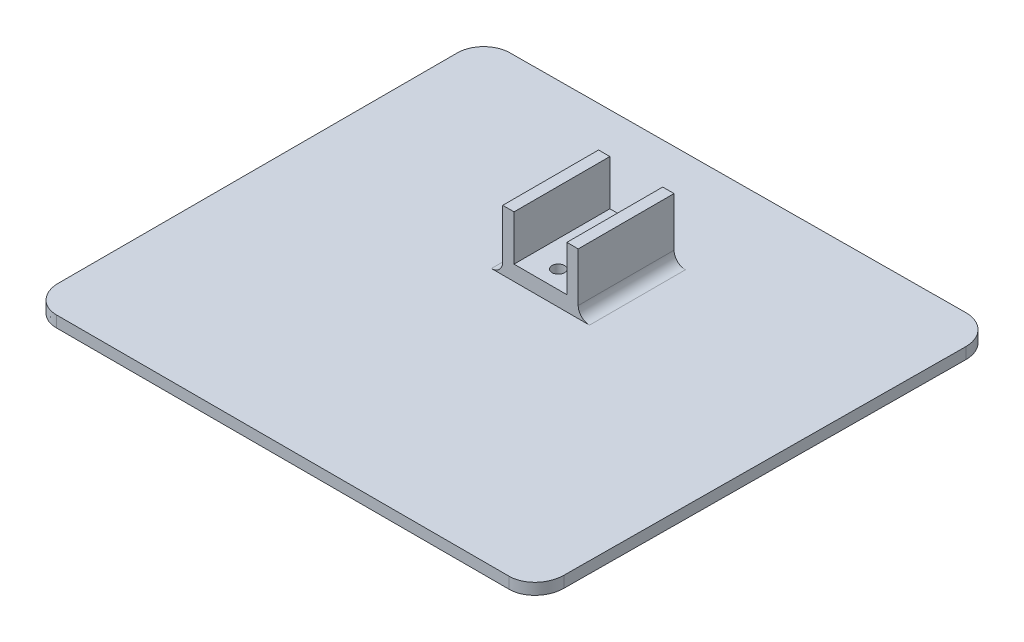
ISO-10303-21;
HEADER;
FILE_DESCRIPTION(('STEP AP214'),'2;1');
FILE_NAME('part.step','',(''),(''),'','','');
FILE_SCHEMA(('AUTOMOTIVE_DESIGN { 1 0 10303 214 1 1 1 1 }'));
ENDSEC;
DATA;
#1=APPLICATION_CONTEXT('core data for automotive mechanical design processes');
#2=APPLICATION_PROTOCOL_DEFINITION('international standard','automotive_design',2000,#1);
#3=PRODUCT_CONTEXT('',#1,'mechanical');
#4=PRODUCT('Part','Part','',(#3));
#5=PRODUCT_RELATED_PRODUCT_CATEGORY('part','',(#4));
#6=PRODUCT_DEFINITION_FORMATION('','',#4);
#7=PRODUCT_DEFINITION_CONTEXT('part definition',#1,'design');
#8=PRODUCT_DEFINITION('design','',#6,#7);
#9=PRODUCT_DEFINITION_SHAPE('','',#8);
#10=(LENGTH_UNIT() NAMED_UNIT(*) SI_UNIT(.MILLI.,.METRE.));
#11=(NAMED_UNIT(*) PLANE_ANGLE_UNIT() SI_UNIT($,.RADIAN.));
#12=(NAMED_UNIT(*) SI_UNIT($,.STERADIAN.) SOLID_ANGLE_UNIT());
#13=UNCERTAINTY_MEASURE_WITH_UNIT(LENGTH_MEASURE(1.E-05),#10,'distance_accuracy_value','');
#14=(GEOMETRIC_REPRESENTATION_CONTEXT(3) GLOBAL_UNCERTAINTY_ASSIGNED_CONTEXT((#13)) GLOBAL_UNIT_ASSIGNED_CONTEXT((#10,
#11,#12)) REPRESENTATION_CONTEXT('',''));
#15=CARTESIAN_POINT('',(0.,0.,0.));
#16=DIRECTION('',(0.,0.,1.));
#17=DIRECTION('',(1.,0.,0.));
#18=AXIS2_PLACEMENT_3D('',#15,#16,#17);
#19=CARTESIAN_POINT('',(-0.623651939579232,3.,-8.67766742083026));
#20=DIRECTION('',(0.,-1.,0.));
#21=DIRECTION('',(0.,0.,-1.));
#22=AXIS2_PLACEMENT_3D('',#19,#20,#21);
#23=CYLINDRICAL_SURFACE('',#22,1.65586460411408);
#24=CARTESIAN_POINT('',(-0.623651939579232,7.,-8.67766742083026));
#25=DIRECTION('',(0.,-1.,0.));
#26=DIRECTION('',(0.,0.,-1.));
#27=AXIS2_PLACEMENT_3D('',#24,#25,#26);
#28=CIRCLE('',#27,1.65586460411408);
#29=CARTESIAN_POINT('',(-0.623651939579232,7.,-10.3335320249443));
#30=VERTEX_POINT('',#29);
#31=EDGE_CURVE('E336',#30,#30,#28,.T.);
#32=ORIENTED_EDGE('',*,*,#31,.F.);
#33=EDGE_LOOP('',(#32));
#34=FACE_BOUND('',#33,.T.);
#35=CARTESIAN_POINT('',(-0.623651939579232,3.,-8.67766742083026));
#36=DIRECTION('',(0.,-1.,0.));
#37=DIRECTION('',(0.,0.,-1.));
#38=AXIS2_PLACEMENT_3D('',#35,#36,#37);
#39=CIRCLE('',#38,1.65586460411408);
#40=CARTESIAN_POINT('',(-0.623651939579232,3.,-10.3335320249443));
#41=VERTEX_POINT('',#40);
#42=EDGE_CURVE('E45',#41,#41,#39,.T.);
#43=ORIENTED_EDGE('',*,*,#42,.T.);
#44=EDGE_LOOP('',(#43));
#45=FACE_BOUND('',#44,.T.);
#46=ADVANCED_FACE('F41',(#34,#45),#23,.F.);
#47=CARTESIAN_POINT('',(-0.623651939579233,3.,-23.293074000594));
#48=DIRECTION('',(0.,-1.,0.));
#49=DIRECTION('',(0.,0.,-1.));
#50=AXIS2_PLACEMENT_3D('',#47,#48,#49);
#51=CYLINDRICAL_SURFACE('',#50,1.65586460411408);
#52=CARTESIAN_POINT('',(-0.623651939579233,7.,-23.293074000594));
#53=DIRECTION('',(0.,-1.,0.));
#54=DIRECTION('',(0.,0.,-1.));
#55=AXIS2_PLACEMENT_3D('',#52,#53,#54);
#56=CIRCLE('',#55,1.65586460411408);
#57=CARTESIAN_POINT('',(-0.623651939579233,7.,-24.9489386047081));
#58=VERTEX_POINT('',#57);
#59=EDGE_CURVE('E332',#58,#58,#56,.T.);
#60=ORIENTED_EDGE('',*,*,#59,.F.);
#61=EDGE_LOOP('',(#60));
#62=FACE_BOUND('',#61,.T.);
#63=CARTESIAN_POINT('',(-0.623651939579233,3.,-23.293074000594));
#64=DIRECTION('',(0.,-1.,0.));
#65=DIRECTION('',(0.,0.,-1.));
#66=AXIS2_PLACEMENT_3D('',#63,#64,#65);
#67=CIRCLE('',#66,1.65586460411408);
#68=CARTESIAN_POINT('',(-0.623651939579233,3.,-24.9489386047081));
#69=VERTEX_POINT('',#68);
#70=EDGE_CURVE('E293',#69,#69,#67,.T.);
#71=ORIENTED_EDGE('',*,*,#70,.T.);
#72=EDGE_LOOP('',(#71));
#73=FACE_BOUND('',#72,.T.);
#74=ADVANCED_FACE('F258',(#62,#73),#51,.F.);
#75=CARTESIAN_POINT('',(0.,19.,0.));
#76=DIRECTION('',(0.,1.,0.));
#77=DIRECTION('',(0.,0.,1.));
#78=AXIS2_PLACEMENT_3D('',#75,#76,#77);
#79=PLANE('',#78);
#80=DIRECTION('',(-1.,0.,0.));
#81=VECTOR('',#80,1.);
#82=CARTESIAN_POINT('',(-10.6236519395792,19.,-29.348399165478));
#83=LINE('',#82,#81);
#84=CARTESIAN_POINT('',(9.37634806042076,19.,-29.348399165478));
#85=VERTEX_POINT('',#84);
#86=CARTESIAN_POINT('',(6.37634806042076,19.,-29.348399165478));
#87=VERTEX_POINT('',#86);
#88=EDGE_CURVE('E187',#85,#87,#83,.T.);
#89=ORIENTED_EDGE('',*,*,#88,.T.);
#90=DIRECTION('',(0.,0.,1.));
#91=VECTOR('',#90,1.);
#92=CARTESIAN_POINT('',(6.37634806042076,19.,-31.8785328430936));
#93=LINE('',#92,#91);
#94=CARTESIAN_POINT('',(6.37634806042076,19.,-3.94881677280326));
#95=VERTEX_POINT('',#94);
#96=EDGE_CURVE('E169',#87,#95,#93,.T.);
#97=ORIENTED_EDGE('',*,*,#96,.T.);
#98=DIRECTION('',(1.,0.,0.));
#99=VECTOR('',#98,1.);
#100=CARTESIAN_POINT('',(-10.6236519395792,19.,-3.94881677280326));
#101=LINE('',#100,#99);
#102=CARTESIAN_POINT('',(9.37634806042077,19.,-3.94881677280326));
#103=VERTEX_POINT('',#102);
#104=EDGE_CURVE('E347',#95,#103,#101,.T.);
#105=ORIENTED_EDGE('',*,*,#104,.T.);
#106=DIRECTION('',(0.,0.,-1.));
#107=VECTOR('',#106,1.);
#108=CARTESIAN_POINT('',(9.37634806042076,19.,-29.348399165478));
#109=LINE('',#108,#107);
#110=EDGE_CURVE('E195',#103,#85,#109,.T.);
#111=ORIENTED_EDGE('',*,*,#110,.T.);
#112=EDGE_LOOP('',(#89,#97,#105,#111));
#113=FACE_BOUND('',#112,.T.);
#114=ADVANCED_FACE('F193',(#113),#79,.T.);
#115=CARTESIAN_POINT('',(0.,3.,0.));
#116=DIRECTION('',(0.,1.,0.));
#117=DIRECTION('',(0.,0.,1.));
#118=AXIS2_PLACEMENT_3D('',#115,#116,#117);
#119=PLANE('',#118);
#120=DIRECTION('',(1.,0.,0.));
#121=VECTOR('',#120,1.);
#122=CARTESIAN_POINT('',(0.,3.,64.3248615475772));
#123=LINE('',#122,#121);
#124=CARTESIAN_POINT('',(-60.6236519395798,3.,64.3248615475772));
#125=VERTEX_POINT('',#124);
#126=CARTESIAN_POINT('',(59.3763480604208,3.,64.3248615475772));
#127=VERTEX_POINT('',#126);
#128=EDGE_CURVE('E227',#125,#127,#123,.T.);
#129=ORIENTED_EDGE('',*,*,#128,.T.);
#130=CARTESIAN_POINT('',(59.3763480604208,3.,64.3248615475772));
#131=CARTESIAN_POINT('',(59.9969850062149,3.,64.3248615475772));
#132=CARTESIAN_POINT('',(61.275308456134,3.,64.1333593681953));
#133=CARTESIAN_POINT('',(62.8568319045159,3.,63.4055671558471));
#134=CARTESIAN_POINT('',(64.0775733944068,3.,62.4473348495665));
#135=CARTESIAN_POINT('',(65.2823738662636,3.,61.0234651460956));
#136=CARTESIAN_POINT('',(66.1583641025581,3.,59.118925071913));
#137=CARTESIAN_POINT('',(66.3763480604208,3.,57.5809645063272));
#138=CARTESIAN_POINT('',(66.3763480604208,3.,56.8014475552084));
#139=B_SPLINE_CURVE_WITH_KNOTS('',3,(#130,#131,#132,#133,#134,#135,#136,#137,#138),
.UNSPECIFIED.,.F.,.F.,(4,1,1,1,1,1,4),(0.,0.125,0.25,0.375,0.5,0.75,1.),.UNSPECIFIED.);
#140=CARTESIAN_POINT('',(66.3763480604208,3.,56.8014475552084));
#141=VERTEX_POINT('',#140);
#142=EDGE_CURVE('E231',#127,#141,#139,.T.);
#143=ORIENTED_EDGE('',*,*,#142,.T.);
#144=DIRECTION('',(0.00745697451632561,0.,-0.999972196379011));
#145=VECTOR('',#144,1.);
#146=CARTESIAN_POINT('',(66.7962122762989,3.,0.49811150203485));
#147=LINE('',#146,#145);
#148=CARTESIAN_POINT('',(67.16458045239,3.,-48.8996614574205));
#149=VERTEX_POINT('',#148);
#150=EDGE_CURVE('E238',#141,#149,#147,.T.);
#151=ORIENTED_EDGE('',*,*,#150,.T.);
#152=CARTESIAN_POINT('',(59.3763480604208,3.,-48.8996614574205));
#153=DIRECTION('',(0.,1.,0.));
#154=DIRECTION('',(0.,0.,1.));
#155=AXIS2_PLACEMENT_3D('',#152,#153,#154);
#156=CIRCLE('',#155,7.78823239196932);
#157=CARTESIAN_POINT('',(59.3737592423898,3.,-56.6878934191267));
#158=VERTEX_POINT('',#157);
#159=EDGE_CURVE('E501',#149,#158,#156,.T.);
#160=ORIENTED_EDGE('',*,*,#159,.T.);
#161=DIRECTION('',(-0.999978426516409,0.,0.00656859968088536));
#162=VECTOR('',#161,1.);
#163=CARTESIAN_POINT('',(-0.369790275510784,3.,-56.2954534925322));
#164=LINE('',#163,#162);
#165=CARTESIAN_POINT('',(-60.6236519395792,3.,-55.8996614574205));
#166=VERTEX_POINT('',#165);
#167=EDGE_CURVE('E486',#158,#166,#164,.T.);
#168=ORIENTED_EDGE('',*,*,#167,.T.);
#169=CARTESIAN_POINT('',(-60.6236519395792,3.,-48.8996614574205));
#170=DIRECTION('',(0.,1.,0.));
#171=DIRECTION('',(0.,0.,1.));
#172=AXIS2_PLACEMENT_3D('',#169,#170,#171);
#173=CIRCLE('',#172,7.00000000000001);
#174=CARTESIAN_POINT('',(-67.6236519395792,3.,-48.8996614574205));
#175=VERTEX_POINT('',#174);
#176=EDGE_CURVE('E498',#166,#175,#173,.T.);
#177=ORIENTED_EDGE('',*,*,#176,.T.);
#178=DIRECTION('',(0.,0.,1.));
#179=VECTOR('',#178,1.);
#180=CARTESIAN_POINT('',(-67.6236519395792,3.,0.));
#181=LINE('',#180,#179);
#182=CARTESIAN_POINT('',(-67.6236519395792,3.,56.8014475552087));
#183=VERTEX_POINT('',#182);
#184=EDGE_CURVE('E446',#175,#183,#181,.T.);
#185=ORIENTED_EDGE('',*,*,#184,.T.);
#186=CARTESIAN_POINT('',(-67.6236519395792,3.,56.8014475552087));
#187=CARTESIAN_POINT('',(-67.6236519395792,3.,57.5765290563718));
#188=CARTESIAN_POINT('',(-67.4089454120071,3.,59.1031742420404));
#189=CARTESIAN_POINT('',(-66.5399472637736,3.,61.0079018204527));
#190=CARTESIAN_POINT('',(-65.3340978211243,3.,62.4385039570566));
#191=CARTESIAN_POINT('',(-64.1202473130307,3.,63.3945504024124));
#192=CARTESIAN_POINT('',(-62.5468481008131,3.,64.1272193258779));
#193=CARTESIAN_POINT('',(-61.2506192141264,3.,64.3248615475771));
#194=CARTESIAN_POINT('',(-60.6236519395798,3.,64.3248615475772));
#195=B_SPLINE_CURVE_WITH_KNOTS('',3,(#186,#187,#188,#189,#190,#191,#192,#193,#194),
.UNSPECIFIED.,.F.,.F.,(4,1,1,1,1,1,4),(0.,0.25,0.5,0.625,0.75,0.875,1.),.UNSPECIFIED.);
#196=EDGE_CURVE('E407',#183,#125,#195,.T.);
#197=ORIENTED_EDGE('',*,*,#196,.T.);
#198=EDGE_LOOP('',(#129,#143,#151,#160,#168,#177,#185,#197));
#199=FACE_BOUND('',#198,.T.);
#200=DIRECTION('',(-1.,0.,0.));
#201=VECTOR('',#200,1.);
#202=CARTESIAN_POINT('',(-10.6236519395792,3.,-29.348399165478));
#203=LINE('',#202,#201);
#204=CARTESIAN_POINT('',(12.3763480604208,3.,-29.348399165478));
#205=VERTEX_POINT('',#204);
#206=CARTESIAN_POINT('',(-13.6236519395792,3.,-29.348399165478));
#207=VERTEX_POINT('',#206);
#208=EDGE_CURVE('E211',#205,#207,#203,.T.);
#209=ORIENTED_EDGE('',*,*,#208,.F.);
#210=DIRECTION('',(0.,0.,-1.));
#211=VECTOR('',#210,1.);
#212=CARTESIAN_POINT('',(12.3763480604208,3.,0.));
#213=LINE('',#212,#211);
#214=CARTESIAN_POINT('',(12.3763480604208,3.,-3.94881677280326));
#215=VERTEX_POINT('',#214);
#216=EDGE_CURVE('E278',#205,#215,#213,.F.);
#217=ORIENTED_EDGE('',*,*,#216,.T.);
#218=DIRECTION('',(1.,0.,0.));
#219=VECTOR('',#218,1.);
#220=CARTESIAN_POINT('',(-10.6236519395792,3.,-3.94881677280326));
#221=LINE('',#220,#219);
#222=CARTESIAN_POINT('',(-13.6236519395792,3.,-3.94881677280326));
#223=VERTEX_POINT('',#222);
#224=EDGE_CURVE('E208',#223,#215,#221,.T.);
#225=ORIENTED_EDGE('',*,*,#224,.F.);
#226=DIRECTION('',(0.,0.,1.));
#227=VECTOR('',#226,1.);
#228=CARTESIAN_POINT('',(-13.6236519395792,3.,0.));
#229=LINE('',#228,#227);
#230=EDGE_CURVE('E360',#223,#207,#229,.F.);
#231=ORIENTED_EDGE('',*,*,#230,.T.);
#232=EDGE_LOOP('',(#209,#217,#225,#231));
#233=FACE_BOUND('',#232,.T.);
#234=ADVANCED_FACE('F254',(#199,#233),#119,.T.);
#235=CARTESIAN_POINT('',(0.,3.,64.3248615475772));
#236=DIRECTION('',(0.,0.,-1.));
#237=DIRECTION('',(-1.,0.,0.));
#238=AXIS2_PLACEMENT_3D('',#235,#236,#237);
#239=PLANE('',#238);
#240=DIRECTION('',(1.,0.,0.));
#241=VECTOR('',#240,1.);
#242=CARTESIAN_POINT('',(0.,0.,64.3248615475772));
#243=LINE('',#242,#241);
#244=CARTESIAN_POINT('',(-60.6236519395798,0.,64.3248615475772));
#245=VERTEX_POINT('',#244);
#246=CARTESIAN_POINT('',(59.3763480604208,0.,64.3248615475772));
#247=VERTEX_POINT('',#246);
#248=EDGE_CURVE('E226',#245,#247,#243,.T.);
#249=ORIENTED_EDGE('',*,*,#248,.T.);
#250=DIRECTION('',(0.,-1.,0.));
#251=VECTOR('',#250,1.);
#252=CARTESIAN_POINT('',(59.3763480604208,3.,64.3248615475772));
#253=LINE('',#252,#251);
#254=EDGE_CURVE('E375',#127,#247,#253,.T.);
#255=ORIENTED_EDGE('',*,*,#254,.F.);
#256=ORIENTED_EDGE('',*,*,#128,.F.);
#257=DIRECTION('',(0.,-1.,0.));
#258=VECTOR('',#257,1.);
#259=CARTESIAN_POINT('',(-60.6236519395798,3.,64.3248615475772));
#260=LINE('',#259,#258);
#261=EDGE_CURVE('E403',#125,#245,#260,.T.);
#262=ORIENTED_EDGE('',*,*,#261,.T.);
#263=EDGE_LOOP('',(#249,#255,#256,#262));
#264=FACE_BOUND('',#263,.T.);
#265=ADVANCED_FACE('F249',(#264),#239,.F.);
#266=DIRECTION('',(0.,-1.,0.));
#267=VECTOR('',#266,1.);
#268=SURFACE_OF_LINEAR_EXTRUSION('',#139,#267);
#269=CARTESIAN_POINT('',(59.3763480604208,0.,64.3248615475772));
#270=CARTESIAN_POINT('',(59.9969850062149,0.,64.3248615475772));
#271=CARTESIAN_POINT('',(61.275308456134,0.,64.1333593681953));
#272=CARTESIAN_POINT('',(62.8568319045159,0.,63.4055671558471));
#273=CARTESIAN_POINT('',(64.0775733944068,0.,62.4473348495665));
#274=CARTESIAN_POINT('',(65.2823738662636,0.,61.0234651460956));
#275=CARTESIAN_POINT('',(66.1583641025581,0.,59.118925071913));
#276=CARTESIAN_POINT('',(66.3763480604208,0.,57.5809645063272));
#277=CARTESIAN_POINT('',(66.3763480604208,0.,56.8014475552084));
#278=B_SPLINE_CURVE_WITH_KNOTS('',3,(#269,#270,#271,#272,#273,#274,#275,#276,#277),
.UNSPECIFIED.,.F.,.F.,(4,1,1,1,1,1,4),(0.,0.125,0.25,0.375,0.5,0.75,1.),.UNSPECIFIED.);
#279=CARTESIAN_POINT('',(66.3763480604208,0.,56.8014475552084));
#280=VERTEX_POINT('',#279);
#281=EDGE_CURVE('E430',#247,#280,#278,.T.);
#282=ORIENTED_EDGE('',*,*,#281,.T.);
#283=DIRECTION('',(0.,-1.,0.));
#284=VECTOR('',#283,1.);
#285=CARTESIAN_POINT('',(66.3763480604208,3.,56.8014475552084));
#286=LINE('',#285,#284);
#287=EDGE_CURVE('E379',#141,#280,#286,.T.);
#288=ORIENTED_EDGE('',*,*,#287,.F.);
#289=ORIENTED_EDGE('',*,*,#142,.F.);
#290=ORIENTED_EDGE('',*,*,#254,.T.);
#291=EDGE_LOOP('',(#282,#288,#289,#290));
#292=FACE_BOUND('',#291,.T.);
#293=ADVANCED_FACE('F244',(#292),#268,.F.);
#294=CARTESIAN_POINT('',(66.7962122762989,3.,0.49811150203485));
#295=DIRECTION('',(-0.999972196379011,0.,-0.00745697451632561));
#296=DIRECTION('',(-0.00745697451632561,0.,0.999972196379011));
#297=AXIS2_PLACEMENT_3D('',#294,#295,#296);
#298=PLANE('',#297);
#299=DIRECTION('',(0.00745697451632561,0.,-0.999972196379011));
#300=VECTOR('',#299,1.);
#301=CARTESIAN_POINT('',(66.7962122762989,0.,0.49811150203485));
#302=LINE('',#301,#300);
#303=CARTESIAN_POINT('',(67.16458045239,0.,-48.8996614574205));
#304=VERTEX_POINT('',#303);
#305=EDGE_CURVE('E427',#280,#304,#302,.T.);
#306=ORIENTED_EDGE('',*,*,#305,.T.);
#307=DIRECTION('',(0.,-1.,0.));
#308=VECTOR('',#307,1.);
#309=CARTESIAN_POINT('',(67.16458045239,3.,-48.8996614574205));
#310=LINE('',#309,#308);
#311=EDGE_CURVE('E383',#149,#304,#310,.T.);
#312=ORIENTED_EDGE('',*,*,#311,.F.);
#313=ORIENTED_EDGE('',*,*,#150,.F.);
#314=ORIENTED_EDGE('',*,*,#287,.T.);
#315=EDGE_LOOP('',(#306,#312,#313,#314));
#316=FACE_BOUND('',#315,.T.);
#317=ADVANCED_FACE('F248',(#316),#298,.F.);
#318=CARTESIAN_POINT('',(59.3763480604208,3.,-48.8996614574205));
#319=DIRECTION('',(0.,-1.,0.));
#320=DIRECTION('',(0.,0.,-1.));
#321=AXIS2_PLACEMENT_3D('',#318,#319,#320);
#322=CYLINDRICAL_SURFACE('',#321,7.78823239196932);
#323=CARTESIAN_POINT('',(59.3763480604208,0.,-48.8996614574205));
#324=DIRECTION('',(0.,1.,0.));
#325=DIRECTION('',(0.,0.,1.));
#326=AXIS2_PLACEMENT_3D('',#323,#324,#325);
#327=CIRCLE('',#326,7.78823239196932);
#328=CARTESIAN_POINT('',(59.3737592423898,0.,-56.6878934191267));
#329=VERTEX_POINT('',#328);
#330=EDGE_CURVE('E424',#304,#329,#327,.T.);
#331=ORIENTED_EDGE('',*,*,#330,.T.);
#332=DIRECTION('',(0.,-1.,0.));
#333=VECTOR('',#332,1.);
#334=CARTESIAN_POINT('',(59.3737592423898,3.,-56.6878934191267));
#335=LINE('',#334,#333);
#336=EDGE_CURVE('E387',#158,#329,#335,.T.);
#337=ORIENTED_EDGE('',*,*,#336,.F.);
#338=ORIENTED_EDGE('',*,*,#159,.F.);
#339=ORIENTED_EDGE('',*,*,#311,.T.);
#340=EDGE_LOOP('',(#331,#337,#338,#339));
#341=FACE_BOUND('',#340,.T.);
#342=ADVANCED_FACE('F469',(#341),#322,.T.);
#343=CARTESIAN_POINT('',(-0.369790275510784,3.,-56.2954534925322));
#344=DIRECTION('',(0.00656859968088536,0.,0.999978426516409));
#345=DIRECTION('',(0.999978426516409,0.,-0.00656859968088536));
#346=AXIS2_PLACEMENT_3D('',#343,#344,#345);
#347=PLANE('',#346);
#348=DIRECTION('',(-0.999978426516409,0.,0.00656859968088536));
#349=VECTOR('',#348,1.);
#350=CARTESIAN_POINT('',(-0.369790275510784,0.,-56.2954534925322));
#351=LINE('',#350,#349);
#352=CARTESIAN_POINT('',(-60.6236519395792,0.,-55.8996614574205));
#353=VERTEX_POINT('',#352);
#354=EDGE_CURVE('E421',#329,#353,#351,.T.);
#355=ORIENTED_EDGE('',*,*,#354,.T.);
#356=DIRECTION('',(0.,-1.,0.));
#357=VECTOR('',#356,1.);
#358=CARTESIAN_POINT('',(-60.6236519395792,3.,-55.8996614574205));
#359=LINE('',#358,#357);
#360=EDGE_CURVE('E391',#166,#353,#359,.T.);
#361=ORIENTED_EDGE('',*,*,#360,.F.);
#362=ORIENTED_EDGE('',*,*,#167,.F.);
#363=ORIENTED_EDGE('',*,*,#336,.T.);
#364=EDGE_LOOP('',(#355,#361,#362,#363));
#365=FACE_BOUND('',#364,.T.);
#366=ADVANCED_FACE('F466',(#365),#347,.F.);
#367=CARTESIAN_POINT('',(-60.6236519395792,3.,-48.8996614574205));
#368=DIRECTION('',(0.,-1.,0.));
#369=DIRECTION('',(0.,0.,-1.));
#370=AXIS2_PLACEMENT_3D('',#367,#368,#369);
#371=CYLINDRICAL_SURFACE('',#370,7.00000000000001);
#372=CARTESIAN_POINT('',(-60.6236519395792,0.,-48.8996614574205));
#373=DIRECTION('',(0.,1.,0.));
#374=DIRECTION('',(0.,0.,1.));
#375=AXIS2_PLACEMENT_3D('',#372,#373,#374);
#376=CIRCLE('',#375,7.00000000000001);
#377=CARTESIAN_POINT('',(-67.6236519395792,0.,-48.8996614574205));
#378=VERTEX_POINT('',#377);
#379=EDGE_CURVE('E418',#353,#378,#376,.T.);
#380=ORIENTED_EDGE('',*,*,#379,.T.);
#381=DIRECTION('',(0.,-1.,0.));
#382=VECTOR('',#381,1.);
#383=CARTESIAN_POINT('',(-67.6236519395792,3.,-48.8996614574205));
#384=LINE('',#383,#382);
#385=EDGE_CURVE('E395',#175,#378,#384,.T.);
#386=ORIENTED_EDGE('',*,*,#385,.F.);
#387=ORIENTED_EDGE('',*,*,#176,.F.);
#388=ORIENTED_EDGE('',*,*,#360,.T.);
#389=EDGE_LOOP('',(#380,#386,#387,#388));
#390=FACE_BOUND('',#389,.T.);
#391=ADVANCED_FACE('F462',(#390),#371,.T.);
#392=CARTESIAN_POINT('',(-67.6236519395792,3.,0.));
#393=DIRECTION('',(1.,0.,0.));
#394=DIRECTION('',(0.,0.,-1.));
#395=AXIS2_PLACEMENT_3D('',#392,#393,#394);
#396=PLANE('',#395);
#397=DIRECTION('',(0.,0.,1.));
#398=VECTOR('',#397,1.);
#399=CARTESIAN_POINT('',(-67.6236519395792,0.,0.));
#400=LINE('',#399,#398);
#401=CARTESIAN_POINT('',(-67.6236519395792,0.,56.8014475552087));
#402=VERTEX_POINT('',#401);
#403=EDGE_CURVE('E412',#378,#402,#400,.T.);
#404=ORIENTED_EDGE('',*,*,#403,.T.);
#405=DIRECTION('',(0.,-1.,0.));
#406=VECTOR('',#405,1.);
#407=CARTESIAN_POINT('',(-67.6236519395792,3.,56.8014475552087));
#408=LINE('',#407,#406);
#409=EDGE_CURVE('E399',#183,#402,#408,.T.);
#410=ORIENTED_EDGE('',*,*,#409,.F.);
#411=ORIENTED_EDGE('',*,*,#184,.F.);
#412=ORIENTED_EDGE('',*,*,#385,.T.);
#413=EDGE_LOOP('',(#404,#410,#411,#412));
#414=FACE_BOUND('',#413,.T.);
#415=ADVANCED_FACE('F457',(#414),#396,.F.);
#416=DIRECTION('',(0.,-1.,0.));
#417=VECTOR('',#416,1.);
#418=SURFACE_OF_LINEAR_EXTRUSION('',#195,#417);
#419=CARTESIAN_POINT('',(-67.6236519395792,0.,56.8014475552087));
#420=CARTESIAN_POINT('',(-67.6236519395792,0.,57.5765290563718));
#421=CARTESIAN_POINT('',(-67.4089454120071,0.,59.1031742420404));
#422=CARTESIAN_POINT('',(-66.5399472637736,0.,61.0079018204527));
#423=CARTESIAN_POINT('',(-65.3340978211243,0.,62.4385039570566));
#424=CARTESIAN_POINT('',(-64.1202473130307,0.,63.3945504024124));
#425=CARTESIAN_POINT('',(-62.5468481008131,0.,64.1272193258779));
#426=CARTESIAN_POINT('',(-61.2506192141264,0.,64.3248615475771));
#427=CARTESIAN_POINT('',(-60.6236519395798,0.,64.3248615475772));
#428=B_SPLINE_CURVE_WITH_KNOTS('',3,(#419,#420,#421,#422,#423,#424,#425,#426,#427),
.UNSPECIFIED.,.F.,.F.,(4,1,1,1,1,1,4),(0.,0.25,0.5,0.625,0.75,0.875,1.),.UNSPECIFIED.);
#429=EDGE_CURVE('E232',#402,#245,#428,.T.);
#430=ORIENTED_EDGE('',*,*,#429,.T.);
#431=ORIENTED_EDGE('',*,*,#261,.F.);
#432=ORIENTED_EDGE('',*,*,#196,.F.);
#433=ORIENTED_EDGE('',*,*,#409,.T.);
#434=EDGE_LOOP('',(#430,#431,#432,#433));
#435=FACE_BOUND('',#434,.T.);
#436=ADVANCED_FACE('F452',(#435),#418,.F.);
#437=CARTESIAN_POINT('',(0.,0.,0.));
#438=DIRECTION('',(0.,1.,0.));
#439=DIRECTION('',(0.,0.,1.));
#440=AXIS2_PLACEMENT_3D('',#437,#438,#439);
#441=PLANE('',#440);
#442=CARTESIAN_POINT('',(-0.623651939579233,0.,-23.293074000594));
#443=DIRECTION('',(0.,-1.,0.));
#444=DIRECTION('',(0.,0.,-1.));
#445=AXIS2_PLACEMENT_3D('',#442,#443,#444);
#446=CIRCLE('',#445,3.65586460411409);
#447=CARTESIAN_POINT('',(-0.623651939579233,0.,-26.9489386047081));
#448=VERTEX_POINT('',#447);
#449=EDGE_CURVE('E303',#448,#448,#446,.T.);
#450=ORIENTED_EDGE('',*,*,#449,.F.);
#451=EDGE_LOOP('',(#450));
#452=FACE_BOUND('',#451,.T.);
#453=CARTESIAN_POINT('',(-0.623651939579232,0.,-8.67766742083026));
#454=DIRECTION('',(0.,-1.,0.));
#455=DIRECTION('',(0.,0.,-1.));
#456=AXIS2_PLACEMENT_3D('',#453,#454,#455);
#457=CIRCLE('',#456,3.65586460411408);
#458=CARTESIAN_POINT('',(-0.623651939579232,0.,-12.3335320249443));
#459=VERTEX_POINT('',#458);
#460=EDGE_CURVE('E315',#459,#459,#457,.T.);
#461=ORIENTED_EDGE('',*,*,#460,.F.);
#462=EDGE_LOOP('',(#461));
#463=FACE_BOUND('',#462,.T.);
#464=ORIENTED_EDGE('',*,*,#248,.F.);
#465=ORIENTED_EDGE('',*,*,#429,.F.);
#466=ORIENTED_EDGE('',*,*,#403,.F.);
#467=ORIENTED_EDGE('',*,*,#379,.F.);
#468=ORIENTED_EDGE('',*,*,#354,.F.);
#469=ORIENTED_EDGE('',*,*,#330,.F.);
#470=ORIENTED_EDGE('',*,*,#305,.F.);
#471=ORIENTED_EDGE('',*,*,#281,.F.);
#472=EDGE_LOOP('',(#464,#465,#466,#467,#468,#469,#470,#471));
#473=FACE_BOUND('',#472,.T.);
#474=ADVANCED_FACE('F456',(#452,#463,#473),#441,.F.);
#475=DIRECTION('',(0.,0.,1.));
#476=VECTOR('',#475,1.);
#477=CARTESIAN_POINT('',(-7.62365193957924,19.,-31.8785328430936));
#478=LINE('',#477,#476);
#479=CARTESIAN_POINT('',(-7.62365193957924,19.,-29.348399165478));
#480=VERTEX_POINT('',#479);
#481=CARTESIAN_POINT('',(-7.62365193957923,19.,-3.94881677280326));
#482=VERTEX_POINT('',#481);
#483=EDGE_CURVE('E181',#480,#482,#478,.T.);
#484=ORIENTED_EDGE('',*,*,#483,.F.);
#485=CARTESIAN_POINT('',(-10.6236519395792,19.,-29.348399165478));
#486=VERTEX_POINT('',#485);
#487=EDGE_CURVE('E199',#480,#486,#83,.T.);
#488=ORIENTED_EDGE('',*,*,#487,.T.);
#489=DIRECTION('',(0.,0.,1.));
#490=VECTOR('',#489,1.);
#491=CARTESIAN_POINT('',(-10.6236519395792,19.,-29.348399165478));
#492=LINE('',#491,#490);
#493=CARTESIAN_POINT('',(-10.6236519395792,19.,-3.94881677280326));
#494=VERTEX_POINT('',#493);
#495=EDGE_CURVE('E214',#486,#494,#492,.T.);
#496=ORIENTED_EDGE('',*,*,#495,.T.);
#497=EDGE_CURVE('E348',#494,#482,#101,.T.);
#498=ORIENTED_EDGE('',*,*,#497,.T.);
#499=EDGE_LOOP('',(#484,#488,#496,#498));
#500=FACE_BOUND('',#499,.T.);
#501=ADVANCED_FACE('F515',(#500),#79,.T.);
#502=CARTESIAN_POINT('',(-10.6236519395792,19.,-29.348399165478));
#503=DIRECTION('',(1.,0.,0.));
#504=DIRECTION('',(0.,0.,-1.));
#505=AXIS2_PLACEMENT_3D('',#502,#503,#504);
#506=PLANE('',#505);
#507=DIRECTION('',(0.,-1.,0.));
#508=VECTOR('',#507,1.);
#509=CARTESIAN_POINT('',(-10.6236519395792,19.,-29.348399165478));
#510=LINE('',#509,#508);
#511=CARTESIAN_POINT('',(-10.6236519395792,6.,-29.348399165478));
#512=VERTEX_POINT('',#511);
#513=EDGE_CURVE('E198',#486,#512,#510,.T.);
#514=ORIENTED_EDGE('',*,*,#513,.T.);
#515=DIRECTION('',(0.,0.,1.));
#516=VECTOR('',#515,1.);
#517=CARTESIAN_POINT('',(-10.6236519395792,6.,-29.348399165478));
#518=LINE('',#517,#516);
#519=CARTESIAN_POINT('',(-10.6236519395792,6.,-3.94881677280326));
#520=VERTEX_POINT('',#519);
#521=EDGE_CURVE('E290',#512,#520,#518,.T.);
#522=ORIENTED_EDGE('',*,*,#521,.T.);
#523=DIRECTION('',(0.,-1.,0.));
#524=VECTOR('',#523,1.);
#525=CARTESIAN_POINT('',(-10.6236519395792,19.,-3.94881677280326));
#526=LINE('',#525,#524);
#527=EDGE_CURVE('E222',#494,#520,#526,.T.);
#528=ORIENTED_EDGE('',*,*,#527,.F.);
#529=ORIENTED_EDGE('',*,*,#495,.F.);
#530=EDGE_LOOP('',(#514,#522,#528,#529));
#531=FACE_BOUND('',#530,.T.);
#532=ADVANCED_FACE('F517',(#531),#506,.F.);
#533=CARTESIAN_POINT('',(-10.6236519395792,19.,-3.94881677280326));
#534=DIRECTION('',(0.,0.,-1.));
#535=DIRECTION('',(-1.,0.,0.));
#536=AXIS2_PLACEMENT_3D('',#533,#534,#535);
#537=PLANE('',#536);
#538=DIRECTION('',(-1.,0.,0.));
#539=VECTOR('',#538,1.);
#540=CARTESIAN_POINT('',(-10.6236519395792,7.,-3.94881677280326));
#541=LINE('',#540,#539);
#542=CARTESIAN_POINT('',(6.37634806042076,7.,-3.94881677280326));
#543=VERTEX_POINT('',#542);
#544=CARTESIAN_POINT('',(-7.62365193957923,7.,-3.94881677280326));
#545=VERTEX_POINT('',#544);
#546=EDGE_CURVE('E325',#543,#545,#541,.T.);
#547=ORIENTED_EDGE('',*,*,#546,.T.);
#548=DIRECTION('',(0.,1.,0.));
#549=VECTOR('',#548,1.);
#550=CARTESIAN_POINT('',(-7.62365193957923,19.,-3.94881677280326));
#551=LINE('',#550,#549);
#552=EDGE_CURVE('E212',#545,#482,#551,.T.);
#553=ORIENTED_EDGE('',*,*,#552,.T.);
#554=ORIENTED_EDGE('',*,*,#497,.F.);
#555=ORIENTED_EDGE('',*,*,#527,.T.);
#556=CARTESIAN_POINT('',(-13.6236519395792,6.,-3.94881677280326));
#557=DIRECTION('',(0.,0.,-1.));
#558=DIRECTION('',(-1.,0.,0.));
#559=AXIS2_PLACEMENT_3D('',#556,#557,#558);
#560=CIRCLE('',#559,3.);
#561=EDGE_CURVE('E51',#520,#223,#560,.T.);
#562=ORIENTED_EDGE('',*,*,#561,.T.);
#563=ORIENTED_EDGE('',*,*,#224,.T.);
#564=CARTESIAN_POINT('',(12.3763480604208,6.,-3.94881677280326));
#565=DIRECTION('',(0.,0.,-1.));
#566=DIRECTION('',(-1.,0.,0.));
#567=AXIS2_PLACEMENT_3D('',#564,#565,#566);
#568=CIRCLE('',#567,3.);
#569=CARTESIAN_POINT('',(9.37634806042077,6.,-3.94881677280326));
#570=VERTEX_POINT('',#569);
#571=EDGE_CURVE('E276',#215,#570,#568,.T.);
#572=ORIENTED_EDGE('',*,*,#571,.T.);
#573=DIRECTION('',(0.,-1.,0.));
#574=VECTOR('',#573,1.);
#575=CARTESIAN_POINT('',(9.37634806042077,19.,-3.94881677280326));
#576=LINE('',#575,#574);
#577=EDGE_CURVE('E218',#103,#570,#576,.T.);
#578=ORIENTED_EDGE('',*,*,#577,.F.);
#579=ORIENTED_EDGE('',*,*,#104,.F.);
#580=DIRECTION('',(0.,1.,0.));
#581=VECTOR('',#580,1.);
#582=CARTESIAN_POINT('',(6.37634806042076,19.,-3.94881677280326));
#583=LINE('',#582,#581);
#584=EDGE_CURVE('E176',#543,#95,#583,.T.);
#585=ORIENTED_EDGE('',*,*,#584,.F.);
#586=EDGE_LOOP('',(#547,#553,#554,#555,#562,#563,#572,#578,#579,#585));
#587=FACE_BOUND('',#586,.T.);
#588=ADVANCED_FACE('F355',(#587),#537,.F.);
#589=CARTESIAN_POINT('',(9.37634806042076,19.,-29.348399165478));
#590=DIRECTION('',(-1.,0.,0.));
#591=DIRECTION('',(0.,0.,1.));
#592=AXIS2_PLACEMENT_3D('',#589,#590,#591);
#593=PLANE('',#592);
#594=ORIENTED_EDGE('',*,*,#577,.T.);
#595=DIRECTION('',(0.,0.,-1.));
#596=VECTOR('',#595,1.);
#597=CARTESIAN_POINT('',(9.37634806042076,6.,-29.348399165478));
#598=LINE('',#597,#596);
#599=CARTESIAN_POINT('',(9.37634806042076,6.,-29.348399165478));
#600=VERTEX_POINT('',#599);
#601=EDGE_CURVE('E280',#570,#600,#598,.T.);
#602=ORIENTED_EDGE('',*,*,#601,.T.);
#603=DIRECTION('',(0.,-1.,0.));
#604=VECTOR('',#603,1.);
#605=CARTESIAN_POINT('',(9.37634806042076,19.,-29.348399165478));
#606=LINE('',#605,#604);
#607=EDGE_CURVE('E203',#85,#600,#606,.T.);
#608=ORIENTED_EDGE('',*,*,#607,.F.);
#609=ORIENTED_EDGE('',*,*,#110,.F.);
#610=EDGE_LOOP('',(#594,#602,#608,#609));
#611=FACE_BOUND('',#610,.T.);
#612=ADVANCED_FACE('F357',(#611),#593,.F.);
#613=CARTESIAN_POINT('',(-10.6236519395792,19.,-29.348399165478));
#614=DIRECTION('',(0.,0.,1.));
#615=DIRECTION('',(1.,0.,0.));
#616=AXIS2_PLACEMENT_3D('',#613,#614,#615);
#617=PLANE('',#616);
#618=ORIENTED_EDGE('',*,*,#487,.F.);
#619=DIRECTION('',(0.,-1.,0.));
#620=VECTOR('',#619,1.);
#621=CARTESIAN_POINT('',(-7.62365193957924,19.,-29.348399165478));
#622=LINE('',#621,#620);
#623=CARTESIAN_POINT('',(-7.62365193957924,7.,-29.348399165478));
#624=VERTEX_POINT('',#623);
#625=EDGE_CURVE('E191',#480,#624,#622,.T.);
#626=ORIENTED_EDGE('',*,*,#625,.T.);
#627=DIRECTION('',(1.,0.,0.));
#628=VECTOR('',#627,1.);
#629=CARTESIAN_POINT('',(-10.6236519395792,7.,-29.348399165478));
#630=LINE('',#629,#628);
#631=CARTESIAN_POINT('',(6.37634806042076,7.,-29.348399165478));
#632=VERTEX_POINT('',#631);
#633=EDGE_CURVE('E189',#624,#632,#630,.T.);
#634=ORIENTED_EDGE('',*,*,#633,.T.);
#635=DIRECTION('',(0.,-1.,0.));
#636=VECTOR('',#635,1.);
#637=CARTESIAN_POINT('',(6.37634806042076,19.,-29.348399165478));
#638=LINE('',#637,#636);
#639=EDGE_CURVE('E173',#87,#632,#638,.T.);
#640=ORIENTED_EDGE('',*,*,#639,.F.);
#641=ORIENTED_EDGE('',*,*,#88,.F.);
#642=ORIENTED_EDGE('',*,*,#607,.T.);
#643=CARTESIAN_POINT('',(12.3763480604208,6.,-29.348399165478));
#644=DIRECTION('',(0.,0.,1.));
#645=DIRECTION('',(1.,0.,0.));
#646=AXIS2_PLACEMENT_3D('',#643,#644,#645);
#647=CIRCLE('',#646,3.);
#648=EDGE_CURVE('E284',#600,#205,#647,.T.);
#649=ORIENTED_EDGE('',*,*,#648,.T.);
#650=ORIENTED_EDGE('',*,*,#208,.T.);
#651=CARTESIAN_POINT('',(-13.6236519395792,6.,-29.348399165478));
#652=DIRECTION('',(0.,0.,1.));
#653=DIRECTION('',(1.,0.,0.));
#654=AXIS2_PLACEMENT_3D('',#651,#652,#653);
#655=CIRCLE('',#654,3.);
#656=EDGE_CURVE('E11',#207,#512,#655,.T.);
#657=ORIENTED_EDGE('',*,*,#656,.T.);
#658=ORIENTED_EDGE('',*,*,#513,.F.);
#659=EDGE_LOOP('',(#618,#626,#634,#640,#641,#642,#649,#650,#657,#658));
#660=FACE_BOUND('',#659,.T.);
#661=ADVANCED_FACE('F185',(#660),#617,.F.);
#662=CARTESIAN_POINT('',(-7.62365193957924,7.,-31.8785328430936));
#663=DIRECTION('',(-1.,0.,0.));
#664=DIRECTION('',(0.,0.,1.));
#665=AXIS2_PLACEMENT_3D('',#662,#663,#664);
#666=PLANE('',#665);
#667=DIRECTION('',(0.,0.,1.));
#668=VECTOR('',#667,1.);
#669=CARTESIAN_POINT('',(-7.62365193957924,7.,-31.8785328430936));
#670=LINE('',#669,#668);
#671=EDGE_CURVE('E322',#624,#545,#670,.T.);
#672=ORIENTED_EDGE('',*,*,#671,.F.);
#673=ORIENTED_EDGE('',*,*,#625,.F.);
#674=ORIENTED_EDGE('',*,*,#483,.T.);
#675=ORIENTED_EDGE('',*,*,#552,.F.);
#676=EDGE_LOOP('',(#672,#673,#674,#675));
#677=FACE_BOUND('',#676,.T.);
#678=ADVANCED_FACE('F525',(#677),#666,.F.);
#679=CARTESIAN_POINT('',(6.37634806042076,7.,-31.8785328430936));
#680=DIRECTION('',(-1.,0.,0.));
#681=DIRECTION('',(0.,0.,1.));
#682=AXIS2_PLACEMENT_3D('',#679,#680,#681);
#683=PLANE('',#682);
#684=ORIENTED_EDGE('',*,*,#584,.T.);
#685=ORIENTED_EDGE('',*,*,#96,.F.);
#686=ORIENTED_EDGE('',*,*,#639,.T.);
#687=DIRECTION('',(0.,0.,1.));
#688=VECTOR('',#687,1.);
#689=CARTESIAN_POINT('',(6.37634806042076,7.,-31.8785328430936));
#690=LINE('',#689,#688);
#691=EDGE_CURVE('E319',#632,#543,#690,.T.);
#692=ORIENTED_EDGE('',*,*,#691,.T.);
#693=EDGE_LOOP('',(#684,#685,#686,#692));
#694=FACE_BOUND('',#693,.T.);
#695=ADVANCED_FACE('F171',(#694),#683,.T.);
#696=CARTESIAN_POINT('',(0.,7.,0.));
#697=DIRECTION('',(0.,-1.,0.));
#698=DIRECTION('',(0.,0.,-1.));
#699=AXIS2_PLACEMENT_3D('',#696,#697,#698);
#700=PLANE('',#699);
#701=ORIENTED_EDGE('',*,*,#31,.T.);
#702=EDGE_LOOP('',(#701));
#703=FACE_BOUND('',#702,.T.);
#704=ORIENTED_EDGE('',*,*,#59,.T.);
#705=EDGE_LOOP('',(#704));
#706=FACE_BOUND('',#705,.T.);
#707=ORIENTED_EDGE('',*,*,#691,.F.);
#708=ORIENTED_EDGE('',*,*,#633,.F.);
#709=ORIENTED_EDGE('',*,*,#671,.T.);
#710=ORIENTED_EDGE('',*,*,#546,.F.);
#711=EDGE_LOOP('',(#707,#708,#709,#710));
#712=FACE_BOUND('',#711,.T.);
#713=ADVANCED_FACE('F264',(#703,#706,#712),#700,.F.);
#714=CARTESIAN_POINT('',(12.3763480604208,6.,-29.348399165478));
#715=DIRECTION('',(0.,0.,-1.));
#716=DIRECTION('',(-1.,0.,0.));
#717=AXIS2_PLACEMENT_3D('',#714,#715,#716);
#718=CYLINDRICAL_SURFACE('',#717,3.);
#719=ORIENTED_EDGE('',*,*,#571,.F.);
#720=ORIENTED_EDGE('',*,*,#216,.F.);
#721=ORIENTED_EDGE('',*,*,#648,.F.);
#722=ORIENTED_EDGE('',*,*,#601,.F.);
#723=EDGE_LOOP('',(#719,#720,#721,#722));
#724=FACE_BOUND('',#723,.T.);
#725=ADVANCED_FACE('F262',(#724),#718,.F.);
#726=CARTESIAN_POINT('',(-13.6236519395792,6.,-29.348399165478));
#727=DIRECTION('',(0.,0.,1.));
#728=DIRECTION('',(1.,0.,0.));
#729=AXIS2_PLACEMENT_3D('',#726,#727,#728);
#730=CYLINDRICAL_SURFACE('',#729,3.);
#731=ORIENTED_EDGE('',*,*,#656,.F.);
#732=ORIENTED_EDGE('',*,*,#230,.F.);
#733=ORIENTED_EDGE('',*,*,#561,.F.);
#734=ORIENTED_EDGE('',*,*,#521,.F.);
#735=EDGE_LOOP('',(#731,#732,#733,#734));
#736=FACE_BOUND('',#735,.T.);
#737=ADVANCED_FACE('F43',(#736),#730,.F.);
#738=CARTESIAN_POINT('',(-0.623651939579232,3.,-8.67766742083026));
#739=DIRECTION('',(0.,-1.,0.));
#740=DIRECTION('',(0.,0.,-1.));
#741=AXIS2_PLACEMENT_3D('',#738,#739,#740);
#742=CYLINDRICAL_SURFACE('',#741,3.65586460411408);
#743=CARTESIAN_POINT('',(-0.623651939579232,3.,-8.67766742083026));
#744=DIRECTION('',(0.,-1.,0.));
#745=DIRECTION('',(0.,0.,-1.));
#746=AXIS2_PLACEMENT_3D('',#743,#744,#745);
#747=CIRCLE('',#746,3.65586460411408);
#748=CARTESIAN_POINT('',(-0.623651939579232,3.,-12.3335320249443));
#749=VERTEX_POINT('',#748);
#750=EDGE_CURVE('E309',#749,#749,#747,.T.);
#751=ORIENTED_EDGE('',*,*,#750,.F.);
#752=EDGE_LOOP('',(#751));
#753=FACE_BOUND('',#752,.T.);
#754=ORIENTED_EDGE('',*,*,#460,.T.);
#755=EDGE_LOOP('',(#754));
#756=FACE_BOUND('',#755,.T.);
#757=ADVANCED_FACE('F270',(#753,#756),#742,.F.);
#758=CARTESIAN_POINT('',(-0.623651939579232,3.,-8.67766742083026));
#759=DIRECTION('',(0.,-1.,0.));
#760=DIRECTION('',(0.,0.,-1.));
#761=AXIS2_PLACEMENT_3D('',#758,#759,#760);
#762=PLANE('',#761);
#763=ORIENTED_EDGE('',*,*,#42,.F.);
#764=EDGE_LOOP('',(#763));
#765=FACE_BOUND('',#764,.T.);
#766=ORIENTED_EDGE('',*,*,#750,.T.);
#767=EDGE_LOOP('',(#766));
#768=FACE_BOUND('',#767,.T.);
#769=ADVANCED_FACE('F535',(#765,#768),#762,.T.);
#770=CARTESIAN_POINT('',(-0.623651939579233,3.,-23.293074000594));
#771=DIRECTION('',(0.,-1.,0.));
#772=DIRECTION('',(0.,0.,-1.));
#773=AXIS2_PLACEMENT_3D('',#770,#771,#772);
#774=CYLINDRICAL_SURFACE('',#773,3.65586460411409);
#775=CARTESIAN_POINT('',(-0.623651939579233,3.,-23.293074000594));
#776=DIRECTION('',(0.,-1.,0.));
#777=DIRECTION('',(0.,0.,-1.));
#778=AXIS2_PLACEMENT_3D('',#775,#776,#777);
#779=CIRCLE('',#778,3.65586460411409);
#780=CARTESIAN_POINT('',(-0.623651939579233,3.,-26.9489386047081));
#781=VERTEX_POINT('',#780);
#782=EDGE_CURVE('E296',#781,#781,#779,.T.);
#783=ORIENTED_EDGE('',*,*,#782,.F.);
#784=EDGE_LOOP('',(#783));
#785=FACE_BOUND('',#784,.T.);
#786=ORIENTED_EDGE('',*,*,#449,.T.);
#787=EDGE_LOOP('',(#786));
#788=FACE_BOUND('',#787,.T.);
#789=ADVANCED_FACE('F539',(#785,#788),#774,.F.);
#790=CARTESIAN_POINT('',(-0.623651939579233,3.,-23.293074000594));
#791=DIRECTION('',(0.,-1.,0.));
#792=DIRECTION('',(0.,0.,-1.));
#793=AXIS2_PLACEMENT_3D('',#790,#791,#792);
#794=PLANE('',#793);
#795=ORIENTED_EDGE('',*,*,#70,.F.);
#796=EDGE_LOOP('',(#795));
#797=FACE_BOUND('',#796,.T.);
#798=ORIENTED_EDGE('',*,*,#782,.T.);
#799=EDGE_LOOP('',(#798));
#800=FACE_BOUND('',#799,.T.);
#801=ADVANCED_FACE('F543',(#797,#800),#794,.T.);
#802=CLOSED_SHELL('',(#46,#74,#114,#234,#265,#293,#317,#342,#366,#391,#415,#436,#474,#501,#532,
#588,#612,#661,#678,#695,#713,#725,#737,#757,#769,#789,#801));
#803=MANIFOLD_SOLID_BREP('B2',#802);
#804=ADVANCED_BREP_SHAPE_REPRESENTATION('',(#18,#803),#14);
#805=SHAPE_DEFINITION_REPRESENTATION(#9,#804);
ENDSEC;
END-ISO-10303-21;
